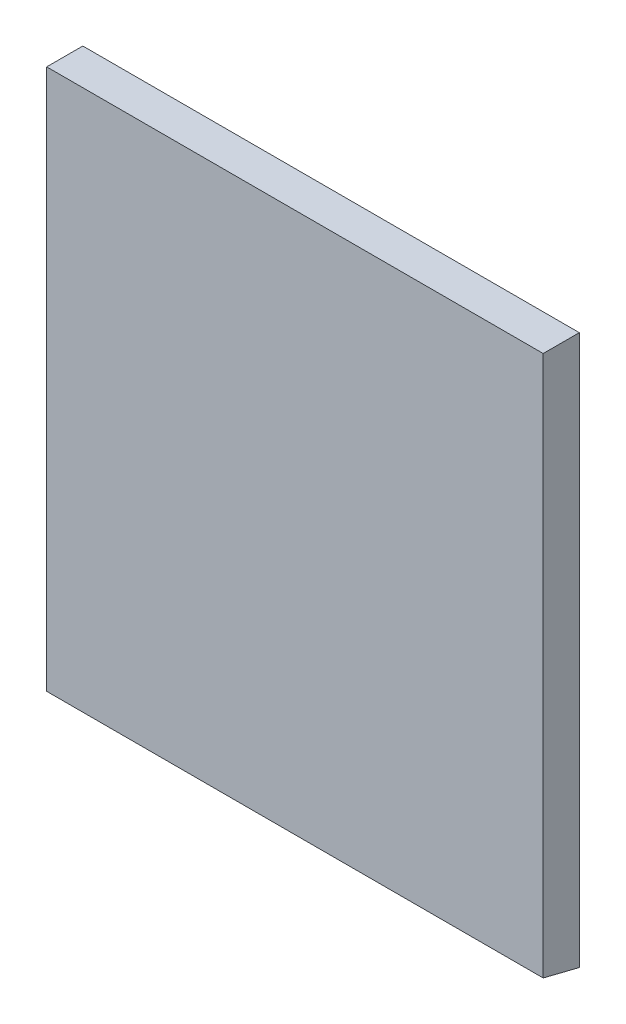
ISO-10303-21;
HEADER;
FILE_DESCRIPTION(('STEP AP214'),'2;1');
FILE_NAME('part.step','',(''),(''),'','','');
FILE_SCHEMA(('AUTOMOTIVE_DESIGN { 1 0 10303 214 1 1 1 1 }'));
ENDSEC;
DATA;
#1=APPLICATION_CONTEXT('core data for automotive mechanical design processes');
#2=APPLICATION_PROTOCOL_DEFINITION('international standard','automotive_design',2000,#1);
#3=PRODUCT_CONTEXT('',#1,'mechanical');
#4=PRODUCT('Part','Part','',(#3));
#5=PRODUCT_RELATED_PRODUCT_CATEGORY('part','',(#4));
#6=PRODUCT_DEFINITION_FORMATION('','',#4);
#7=PRODUCT_DEFINITION_CONTEXT('part definition',#1,'design');
#8=PRODUCT_DEFINITION('design','',#6,#7);
#9=PRODUCT_DEFINITION_SHAPE('','',#8);
#10=(LENGTH_UNIT() NAMED_UNIT(*) SI_UNIT(.MILLI.,.METRE.));
#11=(NAMED_UNIT(*) PLANE_ANGLE_UNIT() SI_UNIT($,.RADIAN.));
#12=(NAMED_UNIT(*) SI_UNIT($,.STERADIAN.) SOLID_ANGLE_UNIT());
#13=UNCERTAINTY_MEASURE_WITH_UNIT(LENGTH_MEASURE(1.E-05),#10,'distance_accuracy_value','');
#14=(GEOMETRIC_REPRESENTATION_CONTEXT(3) GLOBAL_UNCERTAINTY_ASSIGNED_CONTEXT((#13)) GLOBAL_UNIT_ASSIGNED_CONTEXT((#10,
#11,#12)) REPRESENTATION_CONTEXT('',''));
#15=CARTESIAN_POINT('',(0.,0.,0.));
#16=DIRECTION('',(0.,0.,1.));
#17=DIRECTION('',(1.,0.,0.));
#18=AXIS2_PLACEMENT_3D('',#15,#16,#17);
#19=CARTESIAN_POINT('',(-43.66,106.923746647894,-143.154202423773));
#20=DIRECTION('',(0.,0.970295726275996,-0.24192189559967));
#21=DIRECTION('',(0.,0.24192189559967,0.970295726275996));
#22=AXIS2_PLACEMENT_3D('',#19,#20,#21);
#23=PLANE('',#22);
#24=DIRECTION('',(0.,-0.24192189559967,-0.970295726275996));
#25=VECTOR('',#24,1.);
#26=CARTESIAN_POINT('',(-43.65,94.3012173907014,-193.780402101521));
#27=LINE('',#26,#25);
#28=CARTESIAN_POINT('',(-43.65,108.506979465948,-136.804202423773));
#29=VERTEX_POINT('',#28);
#30=CARTESIAN_POINT('',(-43.65,106.923746647894,-143.154202423773));
#31=VERTEX_POINT('',#30);
#32=EDGE_CURVE('E39',#29,#31,#27,.T.);
#33=ORIENTED_EDGE('',*,*,#32,.T.);
#34=DIRECTION('',(-1.,0.,0.));
#35=VECTOR('',#34,1.);
#36=CARTESIAN_POINT('',(50.,106.923746647894,-143.154202423773));
#37=LINE('',#36,#35);
#38=CARTESIAN_POINT('',(43.65,106.923746647894,-143.154202423773));
#39=VERTEX_POINT('',#38);
#40=EDGE_CURVE('E100',#39,#31,#37,.T.);
#41=ORIENTED_EDGE('',*,*,#40,.F.);
#42=DIRECTION('',(0.,0.24192189559967,0.970295726275996));
#43=VECTOR('',#42,1.);
#44=CARTESIAN_POINT('',(43.65,94.3012173907014,-193.780402101521));
#45=LINE('',#44,#43);
#46=CARTESIAN_POINT('',(43.65,108.506979465948,-136.804202423773));
#47=VERTEX_POINT('',#46);
#48=EDGE_CURVE('E103',#39,#47,#45,.T.);
#49=ORIENTED_EDGE('',*,*,#48,.T.);
#50=DIRECTION('',(-1.,0.,0.));
#51=VECTOR('',#50,1.);
#52=CARTESIAN_POINT('',(50.,108.506979465948,-136.804202423773));
#53=LINE('',#52,#51);
#54=EDGE_CURVE('E11',#47,#29,#53,.T.);
#55=ORIENTED_EDGE('',*,*,#54,.T.);
#56=EDGE_LOOP('',(#33,#41,#49,#55));
#57=FACE_BOUND('',#56,.T.);
#58=ADVANCED_FACE('F36',(#57),#23,.F.);
#59=CARTESIAN_POINT('',(43.65,-0.00999999999995449,-170.265974623788));
#60=DIRECTION('',(1.,0.,0.));
#61=DIRECTION('',(0.,0.,-1.));
#62=AXIS2_PLACEMENT_3D('',#59,#60,#61);
#63=PLANE('',#62);
#64=ORIENTED_EDGE('',*,*,#48,.F.);
#65=DIRECTION('',(0.,1.,0.));
#66=VECTOR('',#65,1.);
#67=CARTESIAN_POINT('',(43.65,203.6,-143.154202423773));
#68=LINE('',#67,#66);
#69=CARTESIAN_POINT('',(43.65,203.6,-143.154202423773));
#70=VERTEX_POINT('',#69);
#71=EDGE_CURVE('E90',#39,#70,#68,.T.);
#72=ORIENTED_EDGE('',*,*,#71,.T.);
#73=DIRECTION('',(0.,0.,1.));
#74=VECTOR('',#73,1.);
#75=CARTESIAN_POINT('',(43.65,203.6,-120.654202423773));
#76=LINE('',#75,#74);
#77=CARTESIAN_POINT('',(43.65,203.6,-136.804202423773));
#78=VERTEX_POINT('',#77);
#79=EDGE_CURVE('E91',#70,#78,#76,.T.);
#80=ORIENTED_EDGE('',*,*,#79,.T.);
#81=DIRECTION('',(0.,1.,0.));
#82=VECTOR('',#81,1.);
#83=CARTESIAN_POINT('',(43.65,0.,-136.804202423773));
#84=LINE('',#83,#82);
#85=EDGE_CURVE('E78',#47,#78,#84,.T.);
#86=ORIENTED_EDGE('',*,*,#85,.F.);
#87=EDGE_LOOP('',(#64,#72,#80,#86));
#88=FACE_BOUND('',#87,.T.);
#89=ADVANCED_FACE('F110',(#88),#63,.T.);
#90=CARTESIAN_POINT('',(-43.65,-0.00999999999995449,-170.265974623788));
#91=DIRECTION('',(-1.,0.,0.));
#92=DIRECTION('',(0.,0.,1.));
#93=AXIS2_PLACEMENT_3D('',#90,#91,#92);
#94=PLANE('',#93);
#95=ORIENTED_EDGE('',*,*,#32,.F.);
#96=DIRECTION('',(0.,1.,0.));
#97=VECTOR('',#96,1.);
#98=CARTESIAN_POINT('',(-43.65,0.,-136.804202423773));
#99=LINE('',#98,#97);
#100=CARTESIAN_POINT('',(-43.65,203.6,-136.804202423773));
#101=VERTEX_POINT('',#100);
#102=EDGE_CURVE('E76',#29,#101,#99,.T.);
#103=ORIENTED_EDGE('',*,*,#102,.T.);
#104=DIRECTION('',(0.,0.,-1.));
#105=VECTOR('',#104,1.);
#106=CARTESIAN_POINT('',(-43.65,203.6,-120.654202423773));
#107=LINE('',#106,#105);
#108=CARTESIAN_POINT('',(-43.65,203.6,-143.154202423773));
#109=VERTEX_POINT('',#108);
#110=EDGE_CURVE('E85',#101,#109,#107,.T.);
#111=ORIENTED_EDGE('',*,*,#110,.T.);
#112=DIRECTION('',(0.,-1.,0.));
#113=VECTOR('',#112,1.);
#114=CARTESIAN_POINT('',(-43.65,203.6,-143.154202423773));
#115=LINE('',#114,#113);
#116=EDGE_CURVE('E101',#109,#31,#115,.T.);
#117=ORIENTED_EDGE('',*,*,#116,.T.);
#118=EDGE_LOOP('',(#95,#103,#111,#117));
#119=FACE_BOUND('',#118,.T.);
#120=ADVANCED_FACE('F93',(#119),#94,.T.);
#121=CARTESIAN_POINT('',(50.,203.6,-143.154202423773));
#122=DIRECTION('',(0.,0.,1.));
#123=DIRECTION('',(0.,-1.,0.));
#124=AXIS2_PLACEMENT_3D('',#121,#122,#123);
#125=PLANE('',#124);
#126=ORIENTED_EDGE('',*,*,#116,.F.);
#127=DIRECTION('',(-1.,0.,0.));
#128=VECTOR('',#127,1.);
#129=CARTESIAN_POINT('',(50.,203.6,-143.154202423773));
#130=LINE('',#129,#128);
#131=EDGE_CURVE('E82',#70,#109,#130,.T.);
#132=ORIENTED_EDGE('',*,*,#131,.F.);
#133=ORIENTED_EDGE('',*,*,#71,.F.);
#134=ORIENTED_EDGE('',*,*,#40,.T.);
#135=EDGE_LOOP('',(#126,#132,#133,#134));
#136=FACE_BOUND('',#135,.T.);
#137=ADVANCED_FACE('F107',(#136),#125,.F.);
#138=CARTESIAN_POINT('',(50.,203.6,-120.654202423773));
#139=DIRECTION('',(0.,-1.,0.));
#140=DIRECTION('',(0.,0.,-1.));
#141=AXIS2_PLACEMENT_3D('',#138,#139,#140);
#142=PLANE('',#141);
#143=ORIENTED_EDGE('',*,*,#110,.F.);
#144=DIRECTION('',(-1.,0.,0.));
#145=VECTOR('',#144,1.);
#146=CARTESIAN_POINT('',(50.,203.6,-136.804202423773));
#147=LINE('',#146,#145);
#148=EDGE_CURVE('E72',#78,#101,#147,.T.);
#149=ORIENTED_EDGE('',*,*,#148,.F.);
#150=ORIENTED_EDGE('',*,*,#79,.F.);
#151=ORIENTED_EDGE('',*,*,#131,.T.);
#152=EDGE_LOOP('',(#143,#149,#150,#151));
#153=FACE_BOUND('',#152,.T.);
#154=ADVANCED_FACE('F86',(#153),#142,.F.);
#155=CARTESIAN_POINT('',(50.,203.6,-136.804202423773));
#156=DIRECTION('',(0.,0.,1.));
#157=DIRECTION('',(0.,-1.,0.));
#158=AXIS2_PLACEMENT_3D('',#155,#156,#157);
#159=PLANE('',#158);
#160=ORIENTED_EDGE('',*,*,#102,.F.);
#161=ORIENTED_EDGE('',*,*,#54,.F.);
#162=ORIENTED_EDGE('',*,*,#85,.T.);
#163=ORIENTED_EDGE('',*,*,#148,.T.);
#164=EDGE_LOOP('',(#160,#161,#162,#163));
#165=FACE_BOUND('',#164,.T.);
#166=ADVANCED_FACE('F74',(#165),#159,.T.);
#167=CLOSED_SHELL('',(#58,#89,#120,#137,#154,#166));
#168=MANIFOLD_SOLID_BREP('B2',#167);
#169=ADVANCED_BREP_SHAPE_REPRESENTATION('',(#18,#168),#14);
#170=SHAPE_DEFINITION_REPRESENTATION(#9,#169);
ENDSEC;
END-ISO-10303-21;
